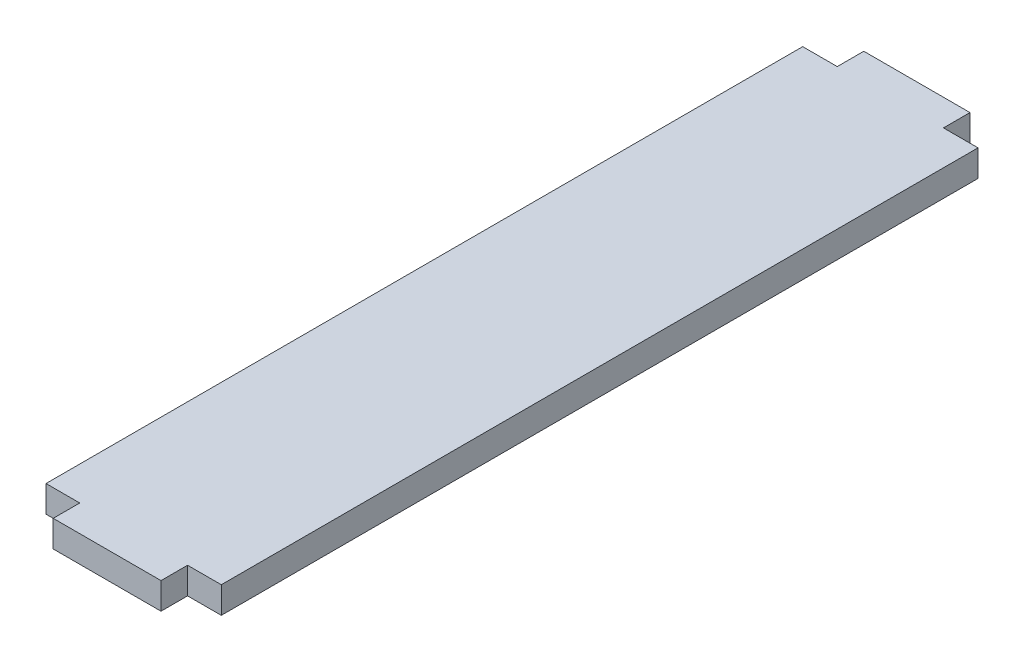
ISO-10303-21;
HEADER;
FILE_DESCRIPTION(('STEP AP214'),'2;1');
FILE_NAME('part.step','',(''),(''),'','','');
FILE_SCHEMA(('AUTOMOTIVE_DESIGN { 1 0 10303 214 1 1 1 1 }'));
ENDSEC;
DATA;
#1=APPLICATION_CONTEXT('core data for automotive mechanical design processes');
#2=APPLICATION_PROTOCOL_DEFINITION('international standard','automotive_design',2000,#1);
#3=PRODUCT_CONTEXT('',#1,'mechanical');
#4=PRODUCT('Part','Part','',(#3));
#5=PRODUCT_RELATED_PRODUCT_CATEGORY('part','',(#4));
#6=PRODUCT_DEFINITION_FORMATION('','',#4);
#7=PRODUCT_DEFINITION_CONTEXT('part definition',#1,'design');
#8=PRODUCT_DEFINITION('design','',#6,#7);
#9=PRODUCT_DEFINITION_SHAPE('','',#8);
#10=(LENGTH_UNIT() NAMED_UNIT(*) SI_UNIT(.MILLI.,.METRE.));
#11=(NAMED_UNIT(*) PLANE_ANGLE_UNIT() SI_UNIT($,.RADIAN.));
#12=(NAMED_UNIT(*) SI_UNIT($,.STERADIAN.) SOLID_ANGLE_UNIT());
#13=UNCERTAINTY_MEASURE_WITH_UNIT(LENGTH_MEASURE(1.E-05),#10,'distance_accuracy_value','');
#14=(GEOMETRIC_REPRESENTATION_CONTEXT(3) GLOBAL_UNCERTAINTY_ASSIGNED_CONTEXT((#13)) GLOBAL_UNIT_ASSIGNED_CONTEXT((#10,
#11,#12)) REPRESENTATION_CONTEXT('',''));
#15=CARTESIAN_POINT('',(0.,0.,0.));
#16=DIRECTION('',(0.,0.,1.));
#17=DIRECTION('',(1.,0.,0.));
#18=AXIS2_PLACEMENT_3D('',#15,#16,#17);
#19=CARTESIAN_POINT('',(0.,5.08,0.));
#20=DIRECTION('',(0.,0.,-1.));
#21=DIRECTION('',(-1.,0.,0.));
#22=AXIS2_PLACEMENT_3D('',#19,#20,#21);
#23=PLANE('',#22);
#24=DIRECTION('',(0.,1.,0.));
#25=VECTOR('',#24,1.);
#26=CARTESIAN_POINT('',(-6.455,0.,0.));
#27=LINE('',#26,#25);
#28=CARTESIAN_POINT('',(-6.455,0.,0.));
#29=VERTEX_POINT('',#28);
#30=CARTESIAN_POINT('',(-6.455,5.08,0.));
#31=VERTEX_POINT('',#30);
#32=EDGE_CURVE('E145',#29,#31,#27,.T.);
#33=ORIENTED_EDGE('',*,*,#32,.F.);
#34=DIRECTION('',(1.,0.,0.));
#35=VECTOR('',#34,1.);
#36=CARTESIAN_POINT('',(0.,0.,0.));
#37=LINE('',#36,#35);
#38=CARTESIAN_POINT('',(0.,0.,0.));
#39=VERTEX_POINT('',#38);
#40=EDGE_CURVE('E198',#29,#39,#37,.T.);
#41=ORIENTED_EDGE('',*,*,#40,.T.);
#42=DIRECTION('',(0.,-1.,0.));
#43=VECTOR('',#42,1.);
#44=CARTESIAN_POINT('',(0.,5.08,0.));
#45=LINE('',#44,#43);
#46=CARTESIAN_POINT('',(0.,5.08,0.));
#47=VERTEX_POINT('',#46);
#48=EDGE_CURVE('E190',#47,#39,#45,.T.);
#49=ORIENTED_EDGE('',*,*,#48,.F.);
#50=DIRECTION('',(1.,0.,0.));
#51=VECTOR('',#50,1.);
#52=CARTESIAN_POINT('',(0.,5.08,0.));
#53=LINE('',#52,#51);
#54=EDGE_CURVE('E48',#31,#47,#53,.T.);
#55=ORIENTED_EDGE('',*,*,#54,.F.);
#56=EDGE_LOOP('',(#33,#41,#49,#55));
#57=FACE_BOUND('',#56,.T.);
#58=ADVANCED_FACE('F33',(#57),#23,.F.);
#59=DIRECTION('',(0.,-1.,0.));
#60=VECTOR('',#59,1.);
#61=CARTESIAN_POINT('',(-27.085,0.,0.));
#62=LINE('',#61,#60);
#63=CARTESIAN_POINT('',(-27.085,5.08,0.));
#64=VERTEX_POINT('',#63);
#65=CARTESIAN_POINT('',(-27.085,0.,0.));
#66=VERTEX_POINT('',#65);
#67=EDGE_CURVE('E56',#64,#66,#62,.T.);
#68=ORIENTED_EDGE('',*,*,#67,.F.);
#69=CARTESIAN_POINT('',(-33.54,5.08,0.));
#70=VERTEX_POINT('',#69);
#71=EDGE_CURVE('E188',#70,#64,#53,.T.);
#72=ORIENTED_EDGE('',*,*,#71,.F.);
#73=DIRECTION('',(0.,-1.,0.));
#74=VECTOR('',#73,1.);
#75=CARTESIAN_POINT('',(-33.54,5.08,0.));
#76=LINE('',#75,#74);
#77=CARTESIAN_POINT('',(-33.54,0.,0.));
#78=VERTEX_POINT('',#77);
#79=EDGE_CURVE('E202',#70,#78,#76,.T.);
#80=ORIENTED_EDGE('',*,*,#79,.T.);
#81=EDGE_CURVE('E182',#78,#66,#37,.T.);
#82=ORIENTED_EDGE('',*,*,#81,.T.);
#83=EDGE_LOOP('',(#68,#72,#80,#82));
#84=FACE_BOUND('',#83,.T.);
#85=ADVANCED_FACE('F220',(#84),#23,.F.);
#86=CARTESIAN_POINT('',(0.,5.08,-144.78));
#87=DIRECTION('',(0.,0.,1.));
#88=DIRECTION('',(1.,0.,0.));
#89=AXIS2_PLACEMENT_3D('',#86,#87,#88);
#90=PLANE('',#89);
#91=DIRECTION('',(0.,-1.,0.));
#92=VECTOR('',#91,1.);
#93=CARTESIAN_POINT('',(-6.61,0.,-144.78));
#94=LINE('',#93,#92);
#95=CARTESIAN_POINT('',(-6.61,5.08,-144.78));
#96=VERTEX_POINT('',#95);
#97=CARTESIAN_POINT('',(-6.61,0.,-144.78));
#98=VERTEX_POINT('',#97);
#99=EDGE_CURVE('E146',#96,#98,#94,.T.);
#100=ORIENTED_EDGE('',*,*,#99,.F.);
#101=DIRECTION('',(-1.,0.,0.));
#102=VECTOR('',#101,1.);
#103=CARTESIAN_POINT('',(0.,5.08,-144.78));
#104=LINE('',#103,#102);
#105=CARTESIAN_POINT('',(0.,5.08,-144.78));
#106=VERTEX_POINT('',#105);
#107=EDGE_CURVE('E183',#106,#96,#104,.T.);
#108=ORIENTED_EDGE('',*,*,#107,.F.);
#109=DIRECTION('',(0.,-1.,0.));
#110=VECTOR('',#109,1.);
#111=CARTESIAN_POINT('',(0.,5.08,-144.78));
#112=LINE('',#111,#110);
#113=CARTESIAN_POINT('',(0.,0.,-144.78));
#114=VERTEX_POINT('',#113);
#115=EDGE_CURVE('E11',#106,#114,#112,.T.);
#116=ORIENTED_EDGE('',*,*,#115,.T.);
#117=DIRECTION('',(-1.,0.,0.));
#118=VECTOR('',#117,1.);
#119=CARTESIAN_POINT('',(0.,0.,-144.78));
#120=LINE('',#119,#118);
#121=EDGE_CURVE('E194',#114,#98,#120,.T.);
#122=ORIENTED_EDGE('',*,*,#121,.T.);
#123=EDGE_LOOP('',(#100,#108,#116,#122));
#124=FACE_BOUND('',#123,.T.);
#125=ADVANCED_FACE('F248',(#124),#90,.F.);
#126=DIRECTION('',(0.,1.,0.));
#127=VECTOR('',#126,1.);
#128=CARTESIAN_POINT('',(-26.93,0.,-144.78));
#129=LINE('',#128,#127);
#130=CARTESIAN_POINT('',(-26.93,0.,-144.78));
#131=VERTEX_POINT('',#130);
#132=CARTESIAN_POINT('',(-26.93,5.08,-144.78));
#133=VERTEX_POINT('',#132);
#134=EDGE_CURVE('E149',#131,#133,#129,.T.);
#135=ORIENTED_EDGE('',*,*,#134,.F.);
#136=CARTESIAN_POINT('',(-33.54,0.,-144.78));
#137=VERTEX_POINT('',#136);
#138=EDGE_CURVE('E193',#131,#137,#120,.T.);
#139=ORIENTED_EDGE('',*,*,#138,.T.);
#140=DIRECTION('',(0.,-1.,0.));
#141=VECTOR('',#140,1.);
#142=CARTESIAN_POINT('',(-33.54,5.08,-144.78));
#143=LINE('',#142,#141);
#144=CARTESIAN_POINT('',(-33.54,5.08,-144.78));
#145=VERTEX_POINT('',#144);
#146=EDGE_CURVE('E41',#145,#137,#143,.T.);
#147=ORIENTED_EDGE('',*,*,#146,.F.);
#148=EDGE_CURVE('E181',#133,#145,#104,.T.);
#149=ORIENTED_EDGE('',*,*,#148,.F.);
#150=EDGE_LOOP('',(#135,#139,#147,#149));
#151=FACE_BOUND('',#150,.T.);
#152=ADVANCED_FACE('F246',(#151),#90,.F.);
#153=CARTESIAN_POINT('',(0.,5.08,0.));
#154=DIRECTION('',(-1.,0.,0.));
#155=DIRECTION('',(0.,0.,1.));
#156=AXIS2_PLACEMENT_3D('',#153,#154,#155);
#157=PLANE('',#156);
#158=DIRECTION('',(0.,0.,-1.));
#159=VECTOR('',#158,1.);
#160=CARTESIAN_POINT('',(0.,0.,0.));
#161=LINE('',#160,#159);
#162=EDGE_CURVE('E178',#39,#114,#161,.T.);
#163=ORIENTED_EDGE('',*,*,#162,.T.);
#164=ORIENTED_EDGE('',*,*,#115,.F.);
#165=DIRECTION('',(0.,0.,-1.));
#166=VECTOR('',#165,1.);
#167=CARTESIAN_POINT('',(0.,5.08,0.));
#168=LINE('',#167,#166);
#169=EDGE_CURVE('E179',#47,#106,#168,.T.);
#170=ORIENTED_EDGE('',*,*,#169,.F.);
#171=ORIENTED_EDGE('',*,*,#48,.T.);
#172=EDGE_LOOP('',(#163,#164,#170,#171));
#173=FACE_BOUND('',#172,.T.);
#174=ADVANCED_FACE('F35',(#173),#157,.F.);
#175=CARTESIAN_POINT('',(-33.54,5.08,0.));
#176=DIRECTION('',(1.,0.,0.));
#177=DIRECTION('',(0.,0.,-1.));
#178=AXIS2_PLACEMENT_3D('',#175,#176,#177);
#179=PLANE('',#178);
#180=DIRECTION('',(0.,0.,1.));
#181=VECTOR('',#180,1.);
#182=CARTESIAN_POINT('',(-33.54,0.,0.));
#183=LINE('',#182,#181);
#184=EDGE_CURVE('E196',#137,#78,#183,.T.);
#185=ORIENTED_EDGE('',*,*,#184,.T.);
#186=ORIENTED_EDGE('',*,*,#79,.F.);
#187=DIRECTION('',(0.,0.,1.));
#188=VECTOR('',#187,1.);
#189=CARTESIAN_POINT('',(-33.54,5.08,0.));
#190=LINE('',#189,#188);
#191=EDGE_CURVE('E186',#145,#70,#190,.T.);
#192=ORIENTED_EDGE('',*,*,#191,.F.);
#193=ORIENTED_EDGE('',*,*,#146,.T.);
#194=EDGE_LOOP('',(#185,#186,#192,#193));
#195=FACE_BOUND('',#194,.T.);
#196=ADVANCED_FACE('F209',(#195),#179,.F.);
#197=CARTESIAN_POINT('',(0.,5.08,0.));
#198=DIRECTION('',(0.,1.,0.));
#199=DIRECTION('',(0.,0.,1.));
#200=AXIS2_PLACEMENT_3D('',#197,#198,#199);
#201=PLANE('',#200);
#202=ORIENTED_EDGE('',*,*,#169,.T.);
#203=ORIENTED_EDGE('',*,*,#107,.T.);
#204=DIRECTION('',(0.,0.,1.));
#205=VECTOR('',#204,1.);
#206=CARTESIAN_POINT('',(-6.61,5.08,-149.86));
#207=LINE('',#206,#205);
#208=CARTESIAN_POINT('',(-6.61,5.08,-149.86));
#209=VERTEX_POINT('',#208);
#210=EDGE_CURVE('E163',#209,#96,#207,.T.);
#211=ORIENTED_EDGE('',*,*,#210,.F.);
#212=DIRECTION('',(1.,0.,0.));
#213=VECTOR('',#212,1.);
#214=CARTESIAN_POINT('',(-26.93,5.08,-149.86));
#215=LINE('',#214,#213);
#216=CARTESIAN_POINT('',(-26.93,5.08,-149.86));
#217=VERTEX_POINT('',#216);
#218=EDGE_CURVE('E162',#217,#209,#215,.T.);
#219=ORIENTED_EDGE('',*,*,#218,.F.);
#220=DIRECTION('',(0.,0.,1.));
#221=VECTOR('',#220,1.);
#222=CARTESIAN_POINT('',(-26.93,5.08,-149.86));
#223=LINE('',#222,#221);
#224=EDGE_CURVE('E169',#217,#133,#223,.T.);
#225=ORIENTED_EDGE('',*,*,#224,.T.);
#226=ORIENTED_EDGE('',*,*,#148,.T.);
#227=ORIENTED_EDGE('',*,*,#191,.T.);
#228=ORIENTED_EDGE('',*,*,#71,.T.);
#229=DIRECTION('',(0.,0.,-1.));
#230=VECTOR('',#229,1.);
#231=CARTESIAN_POINT('',(-27.085,5.08,5.08));
#232=LINE('',#231,#230);
#233=CARTESIAN_POINT('',(-27.085,5.08,5.08));
#234=VERTEX_POINT('',#233);
#235=EDGE_CURVE('E130',#234,#64,#232,.T.);
#236=ORIENTED_EDGE('',*,*,#235,.F.);
#237=DIRECTION('',(-1.,0.,0.));
#238=VECTOR('',#237,1.);
#239=CARTESIAN_POINT('',(-27.085,5.08,5.08));
#240=LINE('',#239,#238);
#241=CARTESIAN_POINT('',(-6.455,5.08,5.08));
#242=VERTEX_POINT('',#241);
#243=EDGE_CURVE('E122',#242,#234,#240,.T.);
#244=ORIENTED_EDGE('',*,*,#243,.F.);
#245=DIRECTION('',(0.,0.,-1.));
#246=VECTOR('',#245,1.);
#247=CARTESIAN_POINT('',(-6.455,5.08,5.08));
#248=LINE('',#247,#246);
#249=EDGE_CURVE('E127',#242,#31,#248,.T.);
#250=ORIENTED_EDGE('',*,*,#249,.T.);
#251=ORIENTED_EDGE('',*,*,#54,.T.);
#252=EDGE_LOOP('',(#202,#203,#211,#219,#225,#226,#227,#228,#236,#244,#250,#251));
#253=FACE_BOUND('',#252,.T.);
#254=ADVANCED_FACE('F125',(#253),#201,.T.);
#255=CARTESIAN_POINT('',(0.,0.,0.));
#256=DIRECTION('',(0.,1.,0.));
#257=DIRECTION('',(0.,0.,1.));
#258=AXIS2_PLACEMENT_3D('',#255,#256,#257);
#259=PLANE('',#258);
#260=ORIENTED_EDGE('',*,*,#162,.F.);
#261=ORIENTED_EDGE('',*,*,#40,.F.);
#262=DIRECTION('',(0.,0.,-1.));
#263=VECTOR('',#262,1.);
#264=CARTESIAN_POINT('',(-6.455,0.,5.08));
#265=LINE('',#264,#263);
#266=CARTESIAN_POINT('',(-6.455,0.,5.08));
#267=VERTEX_POINT('',#266);
#268=EDGE_CURVE('E227',#267,#29,#265,.T.);
#269=ORIENTED_EDGE('',*,*,#268,.F.);
#270=DIRECTION('',(1.,0.,0.));
#271=VECTOR('',#270,1.);
#272=CARTESIAN_POINT('',(-27.085,0.,5.08));
#273=LINE('',#272,#271);
#274=CARTESIAN_POINT('',(-27.085,0.,5.08));
#275=VERTEX_POINT('',#274);
#276=EDGE_CURVE('E139',#275,#267,#273,.T.);
#277=ORIENTED_EDGE('',*,*,#276,.F.);
#278=DIRECTION('',(0.,0.,-1.));
#279=VECTOR('',#278,1.);
#280=CARTESIAN_POINT('',(-27.085,0.,5.08));
#281=LINE('',#280,#279);
#282=EDGE_CURVE('E151',#275,#66,#281,.T.);
#283=ORIENTED_EDGE('',*,*,#282,.T.);
#284=ORIENTED_EDGE('',*,*,#81,.F.);
#285=ORIENTED_EDGE('',*,*,#184,.F.);
#286=ORIENTED_EDGE('',*,*,#138,.F.);
#287=DIRECTION('',(0.,0.,1.));
#288=VECTOR('',#287,1.);
#289=CARTESIAN_POINT('',(-26.93,0.,-149.86));
#290=LINE('',#289,#288);
#291=CARTESIAN_POINT('',(-26.93,0.,-149.86));
#292=VERTEX_POINT('',#291);
#293=EDGE_CURVE('E172',#292,#131,#290,.T.);
#294=ORIENTED_EDGE('',*,*,#293,.F.);
#295=DIRECTION('',(-1.,0.,0.));
#296=VECTOR('',#295,1.);
#297=CARTESIAN_POINT('',(-26.93,0.,-149.86));
#298=LINE('',#297,#296);
#299=CARTESIAN_POINT('',(-6.61,0.,-149.86));
#300=VERTEX_POINT('',#299);
#301=EDGE_CURVE('E158',#300,#292,#298,.T.);
#302=ORIENTED_EDGE('',*,*,#301,.F.);
#303=DIRECTION('',(0.,0.,1.));
#304=VECTOR('',#303,1.);
#305=CARTESIAN_POINT('',(-6.61,0.,-149.86));
#306=LINE('',#305,#304);
#307=EDGE_CURVE('E175',#300,#98,#306,.T.);
#308=ORIENTED_EDGE('',*,*,#307,.T.);
#309=ORIENTED_EDGE('',*,*,#121,.F.);
#310=EDGE_LOOP('',(#260,#261,#269,#277,#283,#284,#285,#286,#294,#302,#308,#309));
#311=FACE_BOUND('',#310,.T.);
#312=ADVANCED_FACE('F216',(#311),#259,.F.);
#313=CARTESIAN_POINT('',(-6.61,0.,-149.86));
#314=DIRECTION('',(-1.,0.,0.));
#315=DIRECTION('',(0.,0.,1.));
#316=AXIS2_PLACEMENT_3D('',#313,#314,#315);
#317=PLANE('',#316);
#318=ORIENTED_EDGE('',*,*,#99,.T.);
#319=ORIENTED_EDGE('',*,*,#307,.F.);
#320=DIRECTION('',(0.,-1.,0.));
#321=VECTOR('',#320,1.);
#322=CARTESIAN_POINT('',(-6.61,0.,-149.86));
#323=LINE('',#322,#321);
#324=EDGE_CURVE('E155',#209,#300,#323,.T.);
#325=ORIENTED_EDGE('',*,*,#324,.F.);
#326=ORIENTED_EDGE('',*,*,#210,.T.);
#327=EDGE_LOOP('',(#318,#319,#325,#326));
#328=FACE_BOUND('',#327,.T.);
#329=ADVANCED_FACE('F238',(#328),#317,.F.);
#330=CARTESIAN_POINT('',(-26.93,0.,-149.86));
#331=DIRECTION('',(1.,0.,0.));
#332=DIRECTION('',(0.,0.,-1.));
#333=AXIS2_PLACEMENT_3D('',#330,#331,#332);
#334=PLANE('',#333);
#335=ORIENTED_EDGE('',*,*,#134,.T.);
#336=ORIENTED_EDGE('',*,*,#224,.F.);
#337=DIRECTION('',(0.,1.,0.));
#338=VECTOR('',#337,1.);
#339=CARTESIAN_POINT('',(-26.93,0.,-149.86));
#340=LINE('',#339,#338);
#341=EDGE_CURVE('E160',#292,#217,#340,.T.);
#342=ORIENTED_EDGE('',*,*,#341,.F.);
#343=ORIENTED_EDGE('',*,*,#293,.T.);
#344=EDGE_LOOP('',(#335,#336,#342,#343));
#345=FACE_BOUND('',#344,.T.);
#346=ADVANCED_FACE('F245',(#345),#334,.F.);
#347=CARTESIAN_POINT('',(0.,0.,-149.86));
#348=DIRECTION('',(0.,0.,-1.));
#349=DIRECTION('',(-1.,0.,0.));
#350=AXIS2_PLACEMENT_3D('',#347,#348,#349);
#351=PLANE('',#350);
#352=ORIENTED_EDGE('',*,*,#324,.T.);
#353=ORIENTED_EDGE('',*,*,#301,.T.);
#354=ORIENTED_EDGE('',*,*,#341,.T.);
#355=ORIENTED_EDGE('',*,*,#218,.T.);
#356=EDGE_LOOP('',(#352,#353,#354,#355));
#357=FACE_BOUND('',#356,.T.);
#358=ADVANCED_FACE('F241',(#357),#351,.T.);
#359=CARTESIAN_POINT('',(-6.455,0.,5.08));
#360=DIRECTION('',(-1.,0.,0.));
#361=DIRECTION('',(0.,-1.,0.));
#362=AXIS2_PLACEMENT_3D('',#359,#360,#361);
#363=PLANE('',#362);
#364=ORIENTED_EDGE('',*,*,#32,.T.);
#365=ORIENTED_EDGE('',*,*,#249,.F.);
#366=DIRECTION('',(0.,1.,0.));
#367=VECTOR('',#366,1.);
#368=CARTESIAN_POINT('',(-6.455,0.,5.08));
#369=LINE('',#368,#367);
#370=EDGE_CURVE('E134',#267,#242,#369,.T.);
#371=ORIENTED_EDGE('',*,*,#370,.F.);
#372=ORIENTED_EDGE('',*,*,#268,.T.);
#373=EDGE_LOOP('',(#364,#365,#371,#372));
#374=FACE_BOUND('',#373,.T.);
#375=ADVANCED_FACE('F144',(#374),#363,.F.);
#376=CARTESIAN_POINT('',(-27.085,0.,5.08));
#377=DIRECTION('',(1.,0.,0.));
#378=DIRECTION('',(0.,0.,-1.));
#379=AXIS2_PLACEMENT_3D('',#376,#377,#378);
#380=PLANE('',#379);
#381=ORIENTED_EDGE('',*,*,#67,.T.);
#382=ORIENTED_EDGE('',*,*,#282,.F.);
#383=DIRECTION('',(0.,-1.,0.));
#384=VECTOR('',#383,1.);
#385=CARTESIAN_POINT('',(-27.085,0.,5.08));
#386=LINE('',#385,#384);
#387=EDGE_CURVE('E133',#234,#275,#386,.T.);
#388=ORIENTED_EDGE('',*,*,#387,.F.);
#389=ORIENTED_EDGE('',*,*,#235,.T.);
#390=EDGE_LOOP('',(#381,#382,#388,#389));
#391=FACE_BOUND('',#390,.T.);
#392=ADVANCED_FACE('F222',(#391),#380,.F.);
#393=CARTESIAN_POINT('',(0.,0.,5.08));
#394=DIRECTION('',(0.,0.,-1.));
#395=DIRECTION('',(-1.,0.,0.));
#396=AXIS2_PLACEMENT_3D('',#393,#394,#395);
#397=PLANE('',#396);
#398=ORIENTED_EDGE('',*,*,#370,.T.);
#399=ORIENTED_EDGE('',*,*,#243,.T.);
#400=ORIENTED_EDGE('',*,*,#387,.T.);
#401=ORIENTED_EDGE('',*,*,#276,.T.);
#402=EDGE_LOOP('',(#398,#399,#400,#401));
#403=FACE_BOUND('',#402,.T.);
#404=ADVANCED_FACE('F137',(#403),#397,.F.);
#405=CLOSED_SHELL('',(#58,#85,#125,#152,#174,#196,#254,#312,#329,#346,#358,#375,#392,#404));
#406=MANIFOLD_SOLID_BREP('B2',#405);
#407=ADVANCED_BREP_SHAPE_REPRESENTATION('',(#18,#406),#14);
#408=SHAPE_DEFINITION_REPRESENTATION(#9,#407);
ENDSEC;
END-ISO-10303-21;
